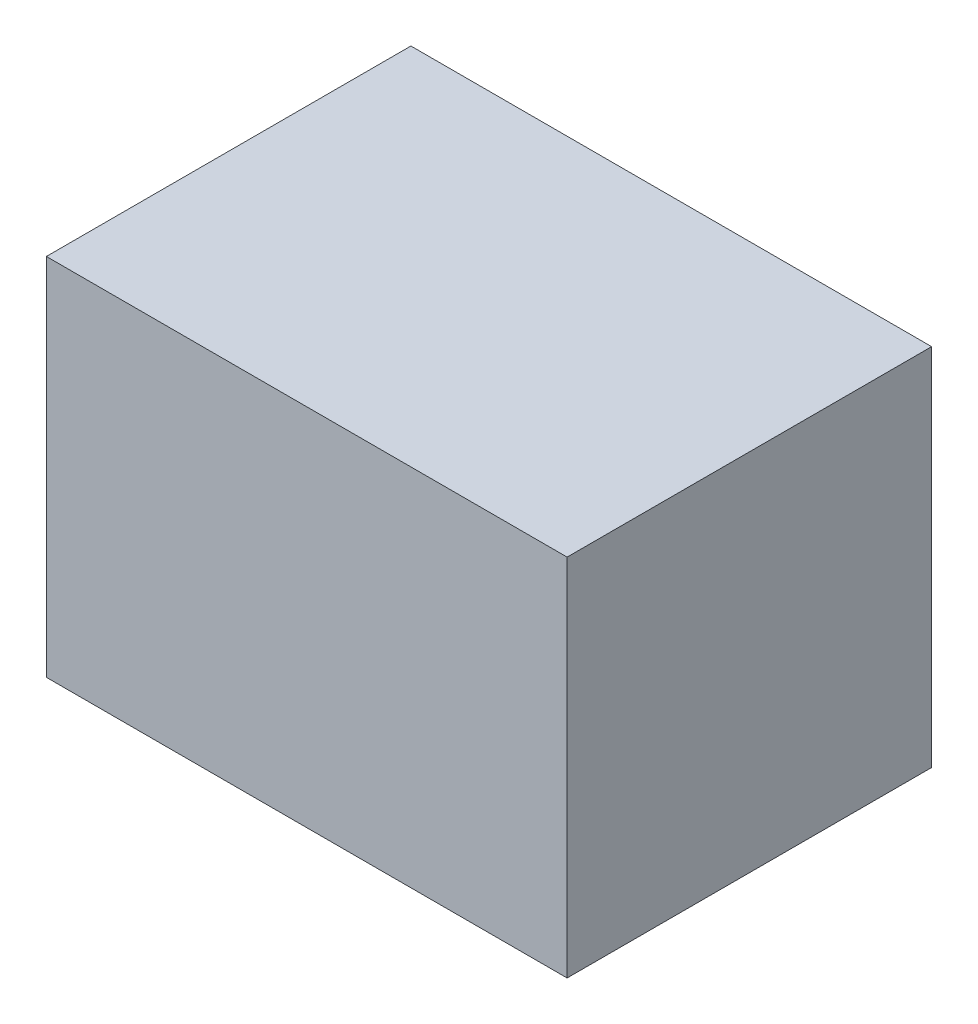
ISO-10303-21;
HEADER;
FILE_DESCRIPTION(('STEP AP214'),'2;1');
FILE_NAME('part.step','',(''),(''),'','','');
FILE_SCHEMA(('AUTOMOTIVE_DESIGN { 1 0 10303 214 1 1 1 1 }'));
ENDSEC;
DATA;
#1=APPLICATION_CONTEXT('core data for automotive mechanical design processes');
#2=APPLICATION_PROTOCOL_DEFINITION('international standard','automotive_design',2000,#1);
#3=PRODUCT_CONTEXT('',#1,'mechanical');
#4=PRODUCT('Part','Part','',(#3));
#5=PRODUCT_RELATED_PRODUCT_CATEGORY('part','',(#4));
#6=PRODUCT_DEFINITION_FORMATION('','',#4);
#7=PRODUCT_DEFINITION_CONTEXT('part definition',#1,'design');
#8=PRODUCT_DEFINITION('design','',#6,#7);
#9=PRODUCT_DEFINITION_SHAPE('','',#8);
#10=(LENGTH_UNIT() NAMED_UNIT(*) SI_UNIT(.MILLI.,.METRE.));
#11=(NAMED_UNIT(*) PLANE_ANGLE_UNIT() SI_UNIT($,.RADIAN.));
#12=(NAMED_UNIT(*) SI_UNIT($,.STERADIAN.) SOLID_ANGLE_UNIT());
#13=UNCERTAINTY_MEASURE_WITH_UNIT(LENGTH_MEASURE(1.E-05),#10,'distance_accuracy_value','');
#14=(GEOMETRIC_REPRESENTATION_CONTEXT(3) GLOBAL_UNCERTAINTY_ASSIGNED_CONTEXT((#13)) GLOBAL_UNIT_ASSIGNED_CONTEXT((#10,
#11,#12)) REPRESENTATION_CONTEXT('',''));
#15=CARTESIAN_POINT('',(0.,0.,0.));
#16=DIRECTION('',(0.,0.,1.));
#17=DIRECTION('',(1.,0.,0.));
#18=AXIS2_PLACEMENT_3D('',#15,#16,#17);
#19=CARTESIAN_POINT('',(-30.48,0.,0.));
#20=DIRECTION('',(0.,1.,0.));
#21=DIRECTION('',(1.,0.,0.));
#22=AXIS2_PLACEMENT_3D('',#19,#20,#21);
#23=PLANE('',#22);
#24=DIRECTION('',(0.,0.,1.));
#25=VECTOR('',#24,1.);
#26=CARTESIAN_POINT('',(-15.49,0.,0.749999999999982));
#27=LINE('',#26,#25);
#28=CARTESIAN_POINT('',(-15.49,0.,0.749999999999982));
#29=VERTEX_POINT('',#28);
#30=CARTESIAN_POINT('',(-15.49,0.,1.1));
#31=VERTEX_POINT('',#30);
#32=EDGE_CURVE('E106',#29,#31,#27,.T.);
#33=ORIENTED_EDGE('',*,*,#32,.T.);
#34=DIRECTION('',(1.,0.,0.));
#35=VECTOR('',#34,1.);
#36=CARTESIAN_POINT('',(-15.49,0.,1.1));
#37=LINE('',#36,#35);
#38=CARTESIAN_POINT('',(-14.99,0.,1.1));
#39=VERTEX_POINT('',#38);
#40=EDGE_CURVE('E27',#31,#39,#37,.T.);
#41=ORIENTED_EDGE('',*,*,#40,.T.);
#42=DIRECTION('',(0.,0.,1.));
#43=VECTOR('',#42,1.);
#44=CARTESIAN_POINT('',(-14.99,0.,0.749999999999982));
#45=LINE('',#44,#43);
#46=CARTESIAN_POINT('',(-14.99,0.,0.749999999999982));
#47=VERTEX_POINT('',#46);
#48=EDGE_CURVE('E72',#47,#39,#45,.T.);
#49=ORIENTED_EDGE('',*,*,#48,.F.);
#50=DIRECTION('',(1.,0.,0.));
#51=VECTOR('',#50,1.);
#52=CARTESIAN_POINT('',(-15.49,0.,0.749999999999982));
#53=LINE('',#52,#51);
#54=EDGE_CURVE('E75',#29,#47,#53,.T.);
#55=ORIENTED_EDGE('',*,*,#54,.F.);
#56=EDGE_LOOP('',(#33,#41,#49,#55));
#57=FACE_BOUND('',#56,.T.);
#58=ADVANCED_FACE('F17',(#57),#23,.T.);
#59=CARTESIAN_POINT('',(-30.48,-0.35,0.));
#60=DIRECTION('',(0.,1.,0.));
#61=DIRECTION('',(1.,0.,0.));
#62=AXIS2_PLACEMENT_3D('',#59,#60,#61);
#63=PLANE('',#62);
#64=DIRECTION('',(0.,0.,1.));
#65=VECTOR('',#64,1.);
#66=CARTESIAN_POINT('',(-15.49,-0.35,0.749999999999982));
#67=LINE('',#66,#65);
#68=CARTESIAN_POINT('',(-15.49,-0.35,0.749999999999982));
#69=VERTEX_POINT('',#68);
#70=CARTESIAN_POINT('',(-15.49,-0.35,1.1));
#71=VERTEX_POINT('',#70);
#72=EDGE_CURVE('E103',#69,#71,#67,.T.);
#73=ORIENTED_EDGE('',*,*,#72,.F.);
#74=DIRECTION('',(1.,0.,0.));
#75=VECTOR('',#74,1.);
#76=CARTESIAN_POINT('',(-15.49,-0.35,0.749999999999982));
#77=LINE('',#76,#75);
#78=CARTESIAN_POINT('',(-14.99,-0.35,0.749999999999982));
#79=VERTEX_POINT('',#78);
#80=EDGE_CURVE('E81',#69,#79,#77,.T.);
#81=ORIENTED_EDGE('',*,*,#80,.T.);
#82=DIRECTION('',(0.,0.,1.));
#83=VECTOR('',#82,1.);
#84=CARTESIAN_POINT('',(-14.99,-0.35,0.749999999999982));
#85=LINE('',#84,#83);
#86=CARTESIAN_POINT('',(-14.99,-0.35,1.1));
#87=VERTEX_POINT('',#86);
#88=EDGE_CURVE('E86',#79,#87,#85,.T.);
#89=ORIENTED_EDGE('',*,*,#88,.T.);
#90=DIRECTION('',(1.,0.,0.));
#91=VECTOR('',#90,1.);
#92=CARTESIAN_POINT('',(-15.49,-0.35,1.1));
#93=LINE('',#92,#91);
#94=EDGE_CURVE('E11',#71,#87,#93,.T.);
#95=ORIENTED_EDGE('',*,*,#94,.F.);
#96=EDGE_LOOP('',(#73,#81,#89,#95));
#97=FACE_BOUND('',#96,.T.);
#98=ADVANCED_FACE('F19',(#97),#63,.F.);
#99=CARTESIAN_POINT('',(-15.49,-0.35,1.1));
#100=DIRECTION('',(0.,0.,1.));
#101=DIRECTION('',(1.,0.,0.));
#102=AXIS2_PLACEMENT_3D('',#99,#100,#101);
#103=PLANE('',#102);
#104=ORIENTED_EDGE('',*,*,#40,.F.);
#105=DIRECTION('',(0.,1.,0.));
#106=VECTOR('',#105,1.);
#107=CARTESIAN_POINT('',(-15.49,-0.35,1.1));
#108=LINE('',#107,#106);
#109=EDGE_CURVE('E21',#71,#31,#108,.T.);
#110=ORIENTED_EDGE('',*,*,#109,.F.);
#111=ORIENTED_EDGE('',*,*,#94,.T.);
#112=DIRECTION('',(0.,1.,0.));
#113=VECTOR('',#112,1.);
#114=CARTESIAN_POINT('',(-14.99,-0.35,1.1));
#115=LINE('',#114,#113);
#116=EDGE_CURVE('E80',#87,#39,#115,.T.);
#117=ORIENTED_EDGE('',*,*,#116,.T.);
#118=EDGE_LOOP('',(#104,#110,#111,#117));
#119=FACE_BOUND('',#118,.T.);
#120=ADVANCED_FACE('F139',(#119),#103,.T.);
#121=CARTESIAN_POINT('',(-14.99,-0.35,0.749999999999982));
#122=DIRECTION('',(-1.,0.,0.));
#123=DIRECTION('',(0.,0.,1.));
#124=AXIS2_PLACEMENT_3D('',#121,#122,#123);
#125=PLANE('',#124);
#126=ORIENTED_EDGE('',*,*,#48,.T.);
#127=ORIENTED_EDGE('',*,*,#116,.F.);
#128=ORIENTED_EDGE('',*,*,#88,.F.);
#129=DIRECTION('',(0.,1.,0.));
#130=VECTOR('',#129,1.);
#131=CARTESIAN_POINT('',(-14.99,-0.35,0.749999999999982));
#132=LINE('',#131,#130);
#133=EDGE_CURVE('E84',#79,#47,#132,.T.);
#134=ORIENTED_EDGE('',*,*,#133,.T.);
#135=EDGE_LOOP('',(#126,#127,#128,#134));
#136=FACE_BOUND('',#135,.T.);
#137=ADVANCED_FACE('F85',(#136),#125,.F.);
#138=CARTESIAN_POINT('',(-15.49,-0.35,0.749999999999982));
#139=DIRECTION('',(0.,0.,1.));
#140=DIRECTION('',(1.,0.,0.));
#141=AXIS2_PLACEMENT_3D('',#138,#139,#140);
#142=PLANE('',#141);
#143=ORIENTED_EDGE('',*,*,#54,.T.);
#144=ORIENTED_EDGE('',*,*,#133,.F.);
#145=ORIENTED_EDGE('',*,*,#80,.F.);
#146=DIRECTION('',(0.,1.,0.));
#147=VECTOR('',#146,1.);
#148=CARTESIAN_POINT('',(-15.49,-0.35,0.749999999999982));
#149=LINE('',#148,#147);
#150=EDGE_CURVE('E93',#69,#29,#149,.T.);
#151=ORIENTED_EDGE('',*,*,#150,.T.);
#152=EDGE_LOOP('',(#143,#144,#145,#151));
#153=FACE_BOUND('',#152,.T.);
#154=ADVANCED_FACE('F91',(#153),#142,.F.);
#155=CARTESIAN_POINT('',(-15.49,-0.35,0.749999999999982));
#156=DIRECTION('',(-1.,0.,0.));
#157=DIRECTION('',(0.,0.,1.));
#158=AXIS2_PLACEMENT_3D('',#155,#156,#157);
#159=PLANE('',#158);
#160=ORIENTED_EDGE('',*,*,#32,.F.);
#161=ORIENTED_EDGE('',*,*,#150,.F.);
#162=ORIENTED_EDGE('',*,*,#72,.T.);
#163=ORIENTED_EDGE('',*,*,#109,.T.);
#164=EDGE_LOOP('',(#160,#161,#162,#163));
#165=FACE_BOUND('',#164,.T.);
#166=ADVANCED_FACE('F126',(#165),#159,.T.);
#167=CLOSED_SHELL('',(#58,#98,#120,#137,#154,#166));
#168=MANIFOLD_SOLID_BREP('B1',#167);
#169=ADVANCED_BREP_SHAPE_REPRESENTATION('',(#18,#168),#14);
#170=SHAPE_DEFINITION_REPRESENTATION(#9,#169);
ENDSEC;
END-ISO-10303-21;
